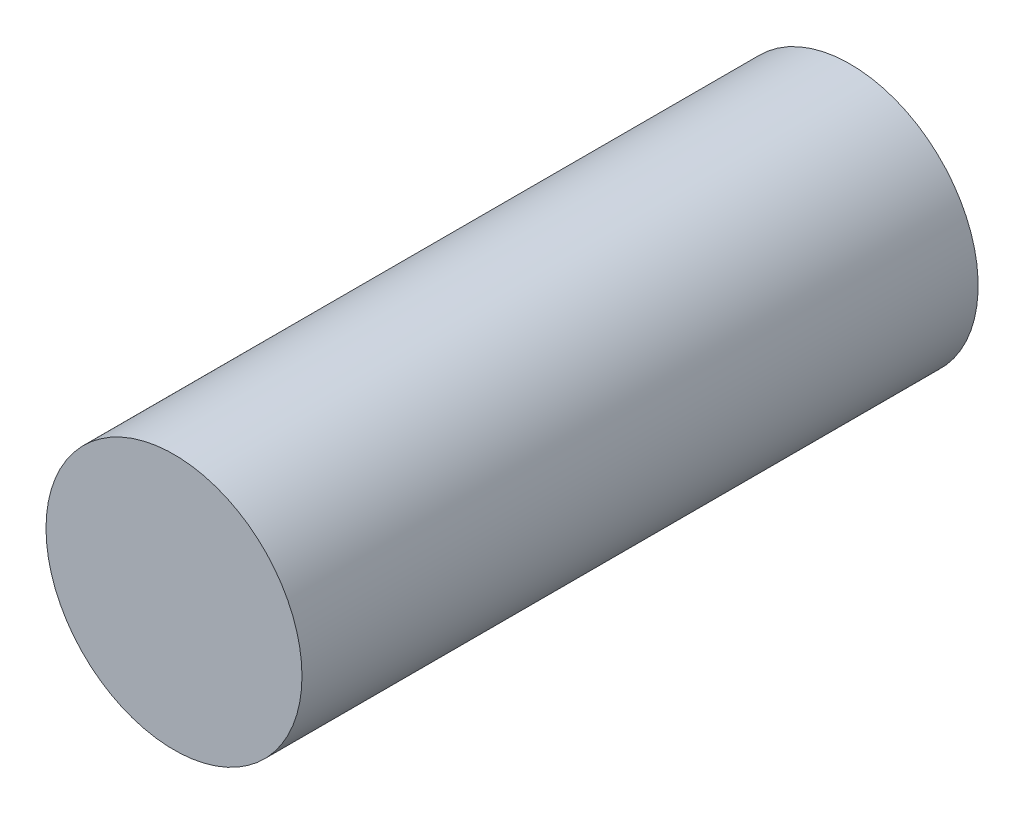
ISO-10303-21;
HEADER;
FILE_DESCRIPTION(('STEP AP214'),'2;1');
FILE_NAME('part.step','',(''),(''),'','','');
FILE_SCHEMA(('AUTOMOTIVE_DESIGN { 1 0 10303 214 1 1 1 1 }'));
ENDSEC;
DATA;
#1=APPLICATION_CONTEXT('core data for automotive mechanical design processes');
#2=APPLICATION_PROTOCOL_DEFINITION('international standard','automotive_design',2000,#1);
#3=PRODUCT_CONTEXT('',#1,'mechanical');
#4=PRODUCT('Part','Part','',(#3));
#5=PRODUCT_RELATED_PRODUCT_CATEGORY('part','',(#4));
#6=PRODUCT_DEFINITION_FORMATION('','',#4);
#7=PRODUCT_DEFINITION_CONTEXT('part definition',#1,'design');
#8=PRODUCT_DEFINITION('design','',#6,#7);
#9=PRODUCT_DEFINITION_SHAPE('','',#8);
#10=(LENGTH_UNIT() NAMED_UNIT(*) SI_UNIT(.MILLI.,.METRE.));
#11=(NAMED_UNIT(*) PLANE_ANGLE_UNIT() SI_UNIT($,.RADIAN.));
#12=(NAMED_UNIT(*) SI_UNIT($,.STERADIAN.) SOLID_ANGLE_UNIT());
#13=UNCERTAINTY_MEASURE_WITH_UNIT(LENGTH_MEASURE(1.E-05),#10,'distance_accuracy_value','');
#14=(GEOMETRIC_REPRESENTATION_CONTEXT(3) GLOBAL_UNCERTAINTY_ASSIGNED_CONTEXT((#13)) GLOBAL_UNIT_ASSIGNED_CONTEXT((#10,
#11,#12)) REPRESENTATION_CONTEXT('',''));
#15=CARTESIAN_POINT('',(0.,0.,0.));
#16=DIRECTION('',(0.,0.,1.));
#17=DIRECTION('',(1.,0.,0.));
#18=AXIS2_PLACEMENT_3D('',#15,#16,#17);
#19=CARTESIAN_POINT('',(0.,0.,304.8));
#20=DIRECTION('',(0.,0.,-1.));
#21=DIRECTION('',(-1.,0.,0.));
#22=AXIS2_PLACEMENT_3D('',#19,#20,#21);
#23=CYLINDRICAL_SURFACE('',#22,50.8);
#24=CARTESIAN_POINT('',(0.,0.,36.4089274766507));
#25=DIRECTION('',(0.,0.,-1.));
#26=DIRECTION('',(-1.,0.,0.));
#27=AXIS2_PLACEMENT_3D('',#24,#25,#26);
#28=CIRCLE('',#27,50.8);
#29=CARTESIAN_POINT('',(-50.8,0.,36.4089274766507));
#30=VERTEX_POINT('',#29);
#31=EDGE_CURVE('E33',#30,#30,#28,.F.);
#32=ORIENTED_EDGE('',*,*,#31,.T.);
#33=EDGE_LOOP('',(#32));
#34=FACE_BOUND('',#33,.T.);
#35=CARTESIAN_POINT('',(0.,0.,304.8));
#36=DIRECTION('',(0.,0.,1.));
#37=DIRECTION('',(1.,0.,0.));
#38=AXIS2_PLACEMENT_3D('',#35,#36,#37);
#39=CIRCLE('',#38,50.8);
#40=CARTESIAN_POINT('',(50.8,0.,304.8));
#41=VERTEX_POINT('',#40);
#42=EDGE_CURVE('E10',#41,#41,#39,.T.);
#43=ORIENTED_EDGE('',*,*,#42,.F.);
#44=EDGE_LOOP('',(#43));
#45=FACE_BOUND('',#44,.T.);
#46=ADVANCED_FACE('F30',(#34,#45),#23,.T.);
#47=CARTESIAN_POINT('',(0.,0.,304.8));
#48=DIRECTION('',(0.,0.,1.));
#49=DIRECTION('',(1.,0.,0.));
#50=AXIS2_PLACEMENT_3D('',#47,#48,#49);
#51=PLANE('',#50);
#52=ORIENTED_EDGE('',*,*,#42,.T.);
#53=EDGE_LOOP('',(#52));
#54=FACE_BOUND('',#53,.T.);
#55=ADVANCED_FACE('F46',(#54),#51,.T.);
#56=CARTESIAN_POINT('',(0.,0.,0.));
#57=DIRECTION('',(0.,-1.,0.));
#58=DIRECTION('',(-1.,0.,0.));
#59=AXIS2_PLACEMENT_3D('',#56,#57,#58);
#60=SPHERICAL_SURFACE('',#59,62.5);
#61=CARTESIAN_POINT('',(0.,0.,0.));
#62=DIRECTION('',(0.,0.,-1.));
#63=DIRECTION('',(-1.,0.,0.));
#64=AXIS2_PLACEMENT_3D('',#61,#62,#63);
#65=SPHERICAL_SURFACE('',#64,62.5);
#66=ORIENTED_EDGE('',*,*,#31,.F.);
#67=EDGE_LOOP('',(#66));
#68=FACE_BOUND('',#67,.T.);
#69=ADVANCED_FACE('F44',(#68),#65,.F.);
#70=CLOSED_SHELL('',(#46,#55,#69));
#71=MANIFOLD_SOLID_BREP('B2',#70);
#72=ADVANCED_BREP_SHAPE_REPRESENTATION('',(#18,#71),#14);
#73=SHAPE_DEFINITION_REPRESENTATION(#9,#72);
ENDSEC;
END-ISO-10303-21;
